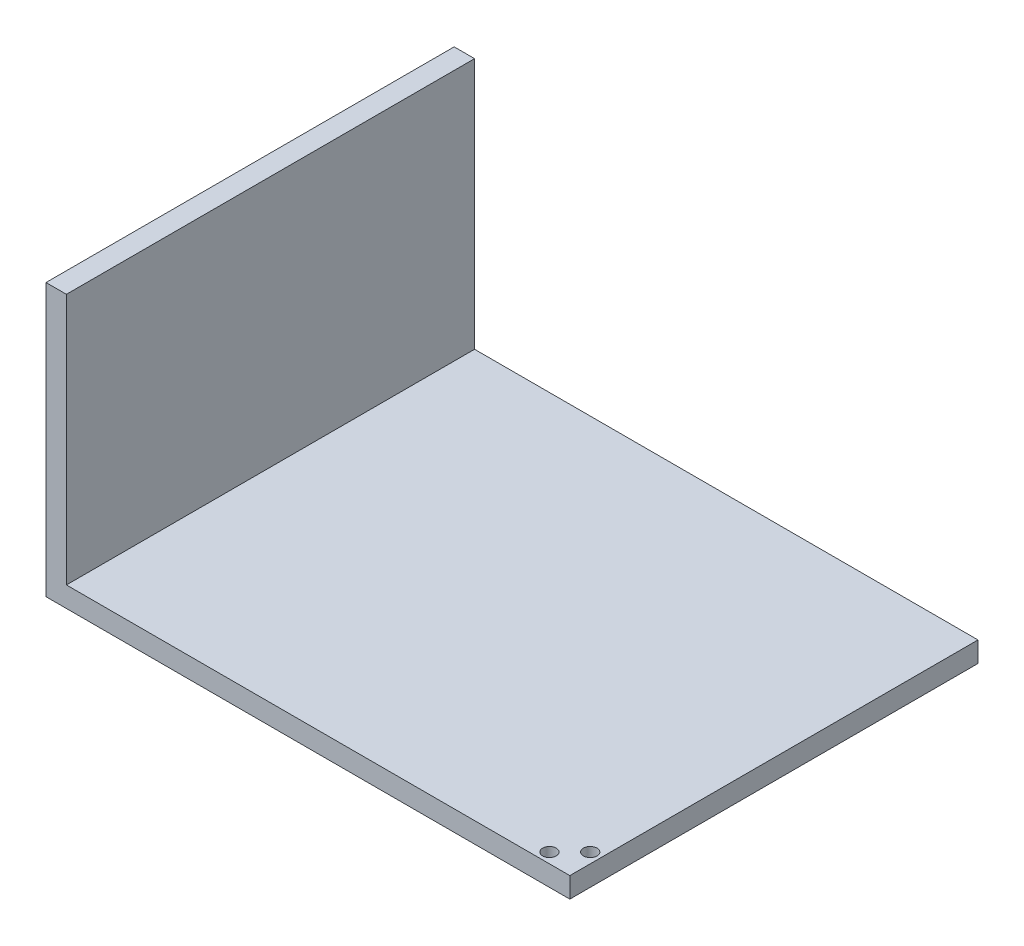
ISO-10303-21;
HEADER;
FILE_DESCRIPTION(('STEP AP214'),'2;1');
FILE_NAME('part.step','',(''),(''),'','','');
FILE_SCHEMA(('AUTOMOTIVE_DESIGN { 1 0 10303 214 1 1 1 1 }'));
ENDSEC;
DATA;
#1=APPLICATION_CONTEXT('core data for automotive mechanical design processes');
#2=APPLICATION_PROTOCOL_DEFINITION('international standard','automotive_design',2000,#1);
#3=PRODUCT_CONTEXT('',#1,'mechanical');
#4=PRODUCT('Part','Part','',(#3));
#5=PRODUCT_RELATED_PRODUCT_CATEGORY('part','',(#4));
#6=PRODUCT_DEFINITION_FORMATION('','',#4);
#7=PRODUCT_DEFINITION_CONTEXT('part definition',#1,'design');
#8=PRODUCT_DEFINITION('design','',#6,#7);
#9=PRODUCT_DEFINITION_SHAPE('','',#8);
#10=(LENGTH_UNIT() NAMED_UNIT(*) SI_UNIT(.MILLI.,.METRE.));
#11=(NAMED_UNIT(*) PLANE_ANGLE_UNIT() SI_UNIT($,.RADIAN.));
#12=(NAMED_UNIT(*) SI_UNIT($,.STERADIAN.) SOLID_ANGLE_UNIT());
#13=UNCERTAINTY_MEASURE_WITH_UNIT(LENGTH_MEASURE(1.E-05),#10,'distance_accuracy_value','');
#14=(GEOMETRIC_REPRESENTATION_CONTEXT(3) GLOBAL_UNCERTAINTY_ASSIGNED_CONTEXT((#13)) GLOBAL_UNIT_ASSIGNED_CONTEXT((#10,
#11,#12)) REPRESENTATION_CONTEXT('',''));
#15=CARTESIAN_POINT('',(0.,0.,0.));
#16=DIRECTION('',(0.,0.,1.));
#17=DIRECTION('',(1.,0.,0.));
#18=AXIS2_PLACEMENT_3D('',#15,#16,#17);
#19=CARTESIAN_POINT('',(0.,7.5,-150.));
#20=DIRECTION('',(0.,0.,1.));
#21=DIRECTION('',(1.,0.,0.));
#22=AXIS2_PLACEMENT_3D('',#19,#20,#21);
#23=PLANE('',#22);
#24=DIRECTION('',(-1.,0.,0.));
#25=VECTOR('',#24,1.);
#26=CARTESIAN_POINT('',(0.,0.,-150.));
#27=LINE('',#26,#25);
#28=CARTESIAN_POINT('',(200.,0.,-150.));
#29=VERTEX_POINT('',#28);
#30=CARTESIAN_POINT('',(7.5,0.,-150.));
#31=VERTEX_POINT('',#30);
#32=EDGE_CURVE('E101',#29,#31,#27,.T.);
#33=ORIENTED_EDGE('',*,*,#32,.T.);
#34=DIRECTION('',(0.,-1.,0.));
#35=VECTOR('',#34,1.);
#36=CARTESIAN_POINT('',(7.5,7.5,-150.));
#37=LINE('',#36,#35);
#38=CARTESIAN_POINT('',(7.5,100.,-150.));
#39=VERTEX_POINT('',#38);
#40=EDGE_CURVE('E11',#39,#31,#37,.T.);
#41=ORIENTED_EDGE('',*,*,#40,.F.);
#42=DIRECTION('',(-1.,0.,0.));
#43=VECTOR('',#42,1.);
#44=CARTESIAN_POINT('',(7.5,100.,-150.));
#45=LINE('',#44,#43);
#46=CARTESIAN_POINT('',(15.,100.,-150.));
#47=VERTEX_POINT('',#46);
#48=EDGE_CURVE('E147',#47,#39,#45,.T.);
#49=ORIENTED_EDGE('',*,*,#48,.F.);
#50=DIRECTION('',(0.,-1.,0.));
#51=VECTOR('',#50,1.);
#52=CARTESIAN_POINT('',(15.,100.,-150.));
#53=LINE('',#52,#51);
#54=CARTESIAN_POINT('',(15.,7.5,-150.));
#55=VERTEX_POINT('',#54);
#56=EDGE_CURVE('E114',#47,#55,#53,.T.);
#57=ORIENTED_EDGE('',*,*,#56,.T.);
#58=DIRECTION('',(-1.,0.,0.));
#59=VECTOR('',#58,1.);
#60=CARTESIAN_POINT('',(0.,7.5,-150.));
#61=LINE('',#60,#59);
#62=CARTESIAN_POINT('',(200.,7.5,-150.));
#63=VERTEX_POINT('',#62);
#64=EDGE_CURVE('E95',#63,#55,#61,.T.);
#65=ORIENTED_EDGE('',*,*,#64,.F.);
#66=DIRECTION('',(0.,-1.,0.));
#67=VECTOR('',#66,1.);
#68=CARTESIAN_POINT('',(200.,7.5,-150.));
#69=LINE('',#68,#67);
#70=EDGE_CURVE('E87',#63,#29,#69,.T.);
#71=ORIENTED_EDGE('',*,*,#70,.T.);
#72=EDGE_LOOP('',(#33,#41,#49,#57,#65,#71));
#73=FACE_BOUND('',#72,.T.);
#74=ADVANCED_FACE('F44',(#73),#23,.F.);
#75=CARTESIAN_POINT('',(7.5,7.5,0.));
#76=DIRECTION('',(1.,0.,0.));
#77=DIRECTION('',(0.,0.,-1.));
#78=AXIS2_PLACEMENT_3D('',#75,#76,#77);
#79=PLANE('',#78);
#80=DIRECTION('',(0.,0.,1.));
#81=VECTOR('',#80,1.);
#82=CARTESIAN_POINT('',(7.5,0.,0.));
#83=LINE('',#82,#81);
#84=CARTESIAN_POINT('',(7.5,0.,0.));
#85=VERTEX_POINT('',#84);
#86=EDGE_CURVE('E106',#31,#85,#83,.T.);
#87=ORIENTED_EDGE('',*,*,#86,.T.);
#88=DIRECTION('',(0.,-1.,0.));
#89=VECTOR('',#88,1.);
#90=CARTESIAN_POINT('',(7.5,7.5,0.));
#91=LINE('',#90,#89);
#92=CARTESIAN_POINT('',(7.5,100.,0.));
#93=VERTEX_POINT('',#92);
#94=EDGE_CURVE('E52',#93,#85,#91,.T.);
#95=ORIENTED_EDGE('',*,*,#94,.F.);
#96=DIRECTION('',(0.,0.,1.));
#97=VECTOR('',#96,1.);
#98=CARTESIAN_POINT('',(7.5,100.,0.));
#99=LINE('',#98,#97);
#100=EDGE_CURVE('E136',#39,#93,#99,.T.);
#101=ORIENTED_EDGE('',*,*,#100,.F.);
#102=ORIENTED_EDGE('',*,*,#40,.T.);
#103=EDGE_LOOP('',(#87,#95,#101,#102));
#104=FACE_BOUND('',#103,.T.);
#105=ADVANCED_FACE('F135',(#104),#79,.F.);
#106=CARTESIAN_POINT('',(0.,7.5,0.));
#107=DIRECTION('',(0.,0.,-1.));
#108=DIRECTION('',(-1.,0.,0.));
#109=AXIS2_PLACEMENT_3D('',#106,#107,#108);
#110=PLANE('',#109);
#111=DIRECTION('',(1.,0.,0.));
#112=VECTOR('',#111,1.);
#113=CARTESIAN_POINT('',(0.,0.,0.));
#114=LINE('',#113,#112);
#115=CARTESIAN_POINT('',(200.,0.,0.));
#116=VERTEX_POINT('',#115);
#117=EDGE_CURVE('E96',#85,#116,#114,.T.);
#118=ORIENTED_EDGE('',*,*,#117,.T.);
#119=DIRECTION('',(0.,-1.,0.));
#120=VECTOR('',#119,1.);
#121=CARTESIAN_POINT('',(200.,7.5,0.));
#122=LINE('',#121,#120);
#123=CARTESIAN_POINT('',(200.,7.5,0.));
#124=VERTEX_POINT('',#123);
#125=EDGE_CURVE('E90',#124,#116,#122,.T.);
#126=ORIENTED_EDGE('',*,*,#125,.F.);
#127=DIRECTION('',(1.,0.,0.));
#128=VECTOR('',#127,1.);
#129=CARTESIAN_POINT('',(0.,7.5,0.));
#130=LINE('',#129,#128);
#131=CARTESIAN_POINT('',(15.,7.5,0.));
#132=VERTEX_POINT('',#131);
#133=EDGE_CURVE('E165',#132,#124,#130,.T.);
#134=ORIENTED_EDGE('',*,*,#133,.F.);
#135=DIRECTION('',(0.,-1.,0.));
#136=VECTOR('',#135,1.);
#137=CARTESIAN_POINT('',(15.,100.,0.));
#138=LINE('',#137,#136);
#139=CARTESIAN_POINT('',(15.,100.,0.));
#140=VERTEX_POINT('',#139);
#141=EDGE_CURVE('E108',#140,#132,#138,.T.);
#142=ORIENTED_EDGE('',*,*,#141,.F.);
#143=DIRECTION('',(1.,0.,0.));
#144=VECTOR('',#143,1.);
#145=CARTESIAN_POINT('',(15.,100.,0.));
#146=LINE('',#145,#144);
#147=EDGE_CURVE('E131',#93,#140,#146,.T.);
#148=ORIENTED_EDGE('',*,*,#147,.F.);
#149=ORIENTED_EDGE('',*,*,#94,.T.);
#150=EDGE_LOOP('',(#118,#126,#134,#142,#148,#149));
#151=FACE_BOUND('',#150,.T.);
#152=ADVANCED_FACE('F127',(#151),#110,.F.);
#153=CARTESIAN_POINT('',(200.,7.5,0.));
#154=DIRECTION('',(-1.,0.,0.));
#155=DIRECTION('',(0.,0.,1.));
#156=AXIS2_PLACEMENT_3D('',#153,#154,#155);
#157=PLANE('',#156);
#158=DIRECTION('',(0.,0.,-1.));
#159=VECTOR('',#158,1.);
#160=CARTESIAN_POINT('',(200.,0.,0.));
#161=LINE('',#160,#159);
#162=EDGE_CURVE('E84',#116,#29,#161,.T.);
#163=ORIENTED_EDGE('',*,*,#162,.T.);
#164=ORIENTED_EDGE('',*,*,#70,.F.);
#165=DIRECTION('',(0.,0.,-1.));
#166=VECTOR('',#165,1.);
#167=CARTESIAN_POINT('',(200.,7.5,0.));
#168=LINE('',#167,#166);
#169=EDGE_CURVE('E65',#124,#63,#168,.T.);
#170=ORIENTED_EDGE('',*,*,#169,.F.);
#171=ORIENTED_EDGE('',*,*,#125,.T.);
#172=EDGE_LOOP('',(#163,#164,#170,#171));
#173=FACE_BOUND('',#172,.T.);
#174=ADVANCED_FACE('F86',(#173),#157,.F.);
#175=CARTESIAN_POINT('',(0.,7.5,0.));
#176=DIRECTION('',(0.,1.,0.));
#177=DIRECTION('',(0.,0.,1.));
#178=AXIS2_PLACEMENT_3D('',#175,#176,#177);
#179=PLANE('',#178);
#180=CARTESIAN_POINT('',(188.75,7.50000000000001,-3.75));
#181=DIRECTION('',(0.,1.,0.));
#182=DIRECTION('',(0.,0.,1.));
#183=AXIS2_PLACEMENT_3D('',#180,#181,#182);
#184=CIRCLE('',#183,2.5);
#185=CARTESIAN_POINT('',(188.75,7.50000000000001,-1.25));
#186=VERTEX_POINT('',#185);
#187=EDGE_CURVE('E162',#186,#186,#184,.T.);
#188=ORIENTED_EDGE('',*,*,#187,.F.);
#189=EDGE_LOOP('',(#188));
#190=FACE_BOUND('',#189,.T.);
#191=CARTESIAN_POINT('',(196.25,7.50000000000001,-11.25));
#192=DIRECTION('',(0.,1.,0.));
#193=DIRECTION('',(0.,0.,1.));
#194=AXIS2_PLACEMENT_3D('',#191,#192,#193);
#195=CIRCLE('',#194,2.5);
#196=CARTESIAN_POINT('',(196.25,7.50000000000001,-8.75));
#197=VERTEX_POINT('',#196);
#198=EDGE_CURVE('E203',#197,#197,#195,.T.);
#199=ORIENTED_EDGE('',*,*,#198,.F.);
#200=EDGE_LOOP('',(#199));
#201=FACE_BOUND('',#200,.T.);
#202=DIRECTION('',(0.,0.,-1.));
#203=VECTOR('',#202,1.);
#204=CARTESIAN_POINT('',(15.,7.5,-150.));
#205=LINE('',#204,#203);
#206=EDGE_CURVE('E59',#132,#55,#205,.T.);
#207=ORIENTED_EDGE('',*,*,#206,.F.);
#208=ORIENTED_EDGE('',*,*,#133,.T.);
#209=ORIENTED_EDGE('',*,*,#169,.T.);
#210=ORIENTED_EDGE('',*,*,#64,.T.);
#211=EDGE_LOOP('',(#207,#208,#209,#210));
#212=FACE_BOUND('',#211,.T.);
#213=ADVANCED_FACE('F168',(#190,#201,#212),#179,.T.);
#214=CARTESIAN_POINT('',(0.,0.,0.));
#215=DIRECTION('',(0.,1.,0.));
#216=DIRECTION('',(0.,0.,1.));
#217=AXIS2_PLACEMENT_3D('',#214,#215,#216);
#218=PLANE('',#217);
#219=CARTESIAN_POINT('',(188.75,0.,-3.75));
#220=DIRECTION('',(0.,-1.,0.));
#221=DIRECTION('',(0.,0.,-1.));
#222=AXIS2_PLACEMENT_3D('',#219,#220,#221);
#223=CIRCLE('',#222,2.5);
#224=CARTESIAN_POINT('',(188.75,0.,-6.25));
#225=VERTEX_POINT('',#224);
#226=EDGE_CURVE('E206',#225,#225,#223,.T.);
#227=ORIENTED_EDGE('',*,*,#226,.F.);
#228=EDGE_LOOP('',(#227));
#229=FACE_BOUND('',#228,.T.);
#230=CARTESIAN_POINT('',(196.25,0.,-11.25));
#231=DIRECTION('',(0.,-1.,0.));
#232=DIRECTION('',(0.,0.,-1.));
#233=AXIS2_PLACEMENT_3D('',#230,#231,#232);
#234=CIRCLE('',#233,2.5);
#235=CARTESIAN_POINT('',(196.25,0.,-13.75));
#236=VERTEX_POINT('',#235);
#237=EDGE_CURVE('E212',#236,#236,#234,.T.);
#238=ORIENTED_EDGE('',*,*,#237,.F.);
#239=EDGE_LOOP('',(#238));
#240=FACE_BOUND('',#239,.T.);
#241=ORIENTED_EDGE('',*,*,#32,.F.);
#242=ORIENTED_EDGE('',*,*,#162,.F.);
#243=ORIENTED_EDGE('',*,*,#117,.F.);
#244=ORIENTED_EDGE('',*,*,#86,.F.);
#245=EDGE_LOOP('',(#241,#242,#243,#244));
#246=FACE_BOUND('',#245,.T.);
#247=ADVANCED_FACE('F105',(#229,#240,#246),#218,.F.);
#248=CARTESIAN_POINT('',(15.,100.,-150.));
#249=DIRECTION('',(-1.,0.,0.));
#250=DIRECTION('',(0.,0.,1.));
#251=AXIS2_PLACEMENT_3D('',#248,#249,#250);
#252=PLANE('',#251);
#253=ORIENTED_EDGE('',*,*,#206,.T.);
#254=ORIENTED_EDGE('',*,*,#56,.F.);
#255=DIRECTION('',(0.,0.,-1.));
#256=VECTOR('',#255,1.);
#257=CARTESIAN_POINT('',(15.,100.,-150.));
#258=LINE('',#257,#256);
#259=EDGE_CURVE('E151',#140,#47,#258,.T.);
#260=ORIENTED_EDGE('',*,*,#259,.F.);
#261=ORIENTED_EDGE('',*,*,#141,.T.);
#262=EDGE_LOOP('',(#253,#254,#260,#261));
#263=FACE_BOUND('',#262,.T.);
#264=ADVANCED_FACE('F170',(#263),#252,.F.);
#265=CARTESIAN_POINT('',(0.,100.,0.));
#266=DIRECTION('',(0.,-1.,0.));
#267=DIRECTION('',(0.,0.,-1.));
#268=AXIS2_PLACEMENT_3D('',#265,#266,#267);
#269=PLANE('',#268);
#270=ORIENTED_EDGE('',*,*,#100,.T.);
#271=ORIENTED_EDGE('',*,*,#147,.T.);
#272=ORIENTED_EDGE('',*,*,#259,.T.);
#273=ORIENTED_EDGE('',*,*,#48,.T.);
#274=EDGE_LOOP('',(#270,#271,#272,#273));
#275=FACE_BOUND('',#274,.T.);
#276=ADVANCED_FACE('F149',(#275),#269,.F.);
#277=CARTESIAN_POINT('',(196.25,92.5,-11.25));
#278=DIRECTION('',(0.,-1.,0.));
#279=DIRECTION('',(0.,0.,-1.));
#280=AXIS2_PLACEMENT_3D('',#277,#278,#279);
#281=CYLINDRICAL_SURFACE('',#280,2.5);
#282=ORIENTED_EDGE('',*,*,#198,.T.);
#283=EDGE_LOOP('',(#282));
#284=FACE_BOUND('',#283,.T.);
#285=ORIENTED_EDGE('',*,*,#237,.T.);
#286=EDGE_LOOP('',(#285));
#287=FACE_BOUND('',#286,.T.);
#288=ADVANCED_FACE('F177',(#284,#287),#281,.F.);
#289=CARTESIAN_POINT('',(188.75,92.5,-3.75));
#290=DIRECTION('',(0.,-1.,0.));
#291=DIRECTION('',(0.,0.,-1.));
#292=AXIS2_PLACEMENT_3D('',#289,#290,#291);
#293=CYLINDRICAL_SURFACE('',#292,2.5);
#294=ORIENTED_EDGE('',*,*,#187,.T.);
#295=EDGE_LOOP('',(#294));
#296=FACE_BOUND('',#295,.T.);
#297=ORIENTED_EDGE('',*,*,#226,.T.);
#298=EDGE_LOOP('',(#297));
#299=FACE_BOUND('',#298,.T.);
#300=ADVANCED_FACE('F224',(#296,#299),#293,.F.);
#301=CLOSED_SHELL('',(#74,#105,#152,#174,#213,#247,#264,#276,#288,#300));
#302=MANIFOLD_SOLID_BREP('B2',#301);
#303=ADVANCED_BREP_SHAPE_REPRESENTATION('',(#18,#302),#14);
#304=SHAPE_DEFINITION_REPRESENTATION(#9,#303);
ENDSEC;
END-ISO-10303-21;
